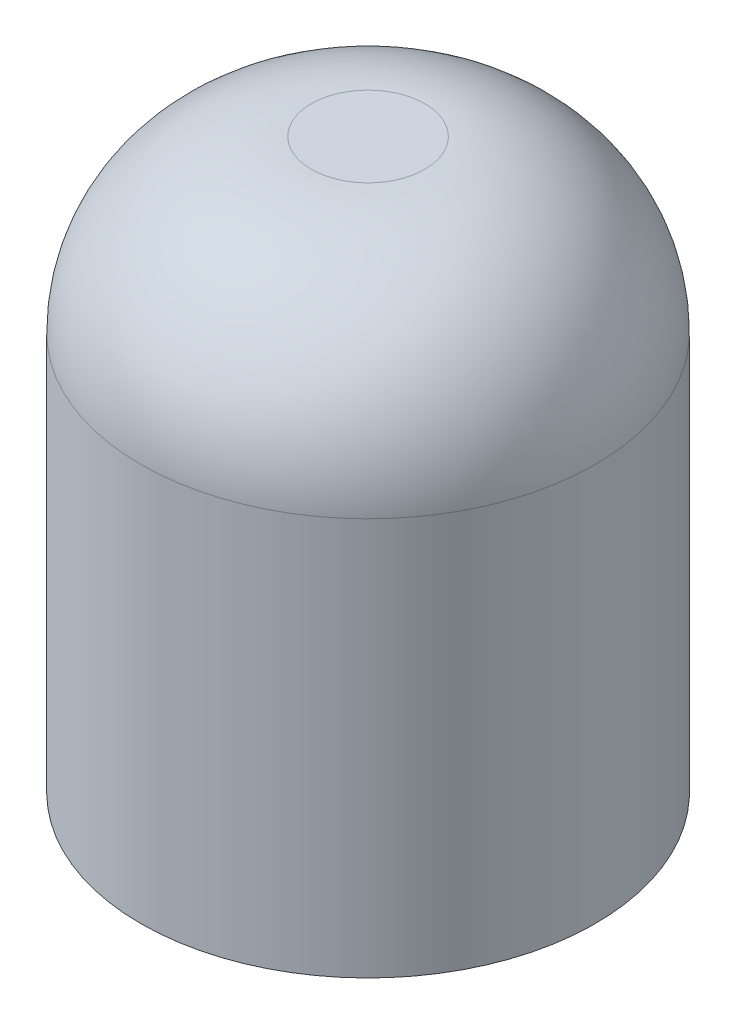
ISO-10303-21;
HEADER;
FILE_DESCRIPTION(('STEP AP214'),'2;1');
FILE_NAME('part.step','',(''),(''),'','','');
FILE_SCHEMA(('AUTOMOTIVE_DESIGN { 1 0 10303 214 1 1 1 1 }'));
ENDSEC;
DATA;
#1=APPLICATION_CONTEXT('core data for automotive mechanical design processes');
#2=APPLICATION_PROTOCOL_DEFINITION('international standard','automotive_design',2000,#1);
#3=PRODUCT_CONTEXT('',#1,'mechanical');
#4=PRODUCT('Part','Part','',(#3));
#5=PRODUCT_RELATED_PRODUCT_CATEGORY('part','',(#4));
#6=PRODUCT_DEFINITION_FORMATION('','',#4);
#7=PRODUCT_DEFINITION_CONTEXT('part definition',#1,'design');
#8=PRODUCT_DEFINITION('design','',#6,#7);
#9=PRODUCT_DEFINITION_SHAPE('','',#8);
#10=(LENGTH_UNIT() NAMED_UNIT(*) SI_UNIT(.MILLI.,.METRE.));
#11=(NAMED_UNIT(*) PLANE_ANGLE_UNIT() SI_UNIT($,.RADIAN.));
#12=(NAMED_UNIT(*) SI_UNIT($,.STERADIAN.) SOLID_ANGLE_UNIT());
#13=UNCERTAINTY_MEASURE_WITH_UNIT(LENGTH_MEASURE(1.E-05),#10,'distance_accuracy_value','');
#14=(GEOMETRIC_REPRESENTATION_CONTEXT(3) GLOBAL_UNCERTAINTY_ASSIGNED_CONTEXT((#13)) GLOBAL_UNIT_ASSIGNED_CONTEXT((#10,
#11,#12)) REPRESENTATION_CONTEXT('',''));
#15=CARTESIAN_POINT('',(0.,0.,0.));
#16=DIRECTION('',(0.,0.,1.));
#17=DIRECTION('',(1.,0.,0.));
#18=AXIS2_PLACEMENT_3D('',#15,#16,#17);
#19=CARTESIAN_POINT('',(0.,10.,0.));
#20=DIRECTION('',(0.,-1.,0.));
#21=DIRECTION('',(0.,0.,-1.));
#22=AXIS2_PLACEMENT_3D('',#19,#20,#21);
#23=CYLINDRICAL_SURFACE('',#22,4.);
#24=CARTESIAN_POINT('',(0.,7.,0.));
#25=DIRECTION('',(0.,1.,0.));
#26=DIRECTION('',(0.,0.,1.));
#27=AXIS2_PLACEMENT_3D('',#24,#25,#26);
#28=CIRCLE('',#27,4.);
#29=CARTESIAN_POINT('',(0.,7.,4.));
#30=VERTEX_POINT('',#29);
#31=EDGE_CURVE('E10',#30,#30,#28,.F.);
#32=ORIENTED_EDGE('',*,*,#31,.T.);
#33=EDGE_LOOP('',(#32));
#34=FACE_BOUND('',#33,.T.);
#35=CARTESIAN_POINT('',(0.,0.,0.));
#36=DIRECTION('',(0.,1.,0.));
#37=DIRECTION('',(0.,0.,1.));
#38=AXIS2_PLACEMENT_3D('',#35,#36,#37);
#39=CIRCLE('',#38,4.);
#40=CARTESIAN_POINT('',(0.,0.,4.));
#41=VERTEX_POINT('',#40);
#42=EDGE_CURVE('E42',#41,#41,#39,.T.);
#43=ORIENTED_EDGE('',*,*,#42,.T.);
#44=EDGE_LOOP('',(#43));
#45=FACE_BOUND('',#44,.T.);
#46=ADVANCED_FACE('F31',(#34,#45),#23,.T.);
#47=CARTESIAN_POINT('',(0.,10.,0.));
#48=DIRECTION('',(0.,1.,0.));
#49=DIRECTION('',(0.,0.,1.));
#50=AXIS2_PLACEMENT_3D('',#47,#48,#49);
#51=PLANE('',#50);
#52=CARTESIAN_POINT('',(0.,10.,0.));
#53=DIRECTION('',(0.,1.,0.));
#54=DIRECTION('',(0.,0.,1.));
#55=AXIS2_PLACEMENT_3D('',#52,#53,#54);
#56=CIRCLE('',#55,1.);
#57=CARTESIAN_POINT('',(0.,10.,1.));
#58=VERTEX_POINT('',#57);
#59=EDGE_CURVE('E38',#58,#58,#56,.T.);
#60=ORIENTED_EDGE('',*,*,#59,.T.);
#61=EDGE_LOOP('',(#60));
#62=FACE_BOUND('',#61,.T.);
#63=ADVANCED_FACE('F66',(#62),#51,.T.);
#64=CARTESIAN_POINT('',(0.,0.,0.));
#65=DIRECTION('',(0.,1.,0.));
#66=DIRECTION('',(0.,0.,1.));
#67=AXIS2_PLACEMENT_3D('',#64,#65,#66);
#68=PLANE('',#67);
#69=CARTESIAN_POINT('',(0.,0.,0.));
#70=DIRECTION('',(0.,-1.,0.));
#71=DIRECTION('',(0.,0.,-1.));
#72=AXIS2_PLACEMENT_3D('',#69,#70,#71);
#73=CIRCLE('',#72,1.5);
#74=CARTESIAN_POINT('',(0.,0.,-1.5));
#75=VERTEX_POINT('',#74);
#76=EDGE_CURVE('E49',#75,#75,#73,.T.);
#77=ORIENTED_EDGE('',*,*,#76,.F.);
#78=EDGE_LOOP('',(#77));
#79=FACE_BOUND('',#78,.T.);
#80=ORIENTED_EDGE('',*,*,#42,.F.);
#81=EDGE_LOOP('',(#80));
#82=FACE_BOUND('',#81,.T.);
#83=ADVANCED_FACE('F63',(#79,#82),#68,.F.);
#84=CARTESIAN_POINT('',(0.,7.,0.));
#85=DIRECTION('',(0.,1.,0.));
#86=DIRECTION('',(0.,0.,1.));
#87=AXIS2_PLACEMENT_3D('',#84,#85,#86);
#88=DEGENERATE_TOROIDAL_SURFACE('',#87,1.,3.,.T.);
#89=ORIENTED_EDGE('',*,*,#31,.F.);
#90=EDGE_LOOP('',(#89));
#91=FACE_BOUND('',#90,.T.);
#92=ORIENTED_EDGE('',*,*,#59,.F.);
#93=EDGE_LOOP('',(#92));
#94=FACE_BOUND('',#93,.T.);
#95=ADVANCED_FACE('F33',(#91,#94),#88,.T.);
#96=CARTESIAN_POINT('',(0.,5.,0.));
#97=DIRECTION('',(0.,-1.,0.));
#98=DIRECTION('',(0.,0.,-1.));
#99=AXIS2_PLACEMENT_3D('',#96,#97,#98);
#100=CYLINDRICAL_SURFACE('',#99,1.5);
#101=CARTESIAN_POINT('',(0.,5.,0.));
#102=DIRECTION('',(0.,-1.,0.));
#103=DIRECTION('',(0.,0.,-1.));
#104=AXIS2_PLACEMENT_3D('',#101,#102,#103);
#105=CIRCLE('',#104,1.5);
#106=CARTESIAN_POINT('',(0.,5.,-1.5));
#107=VERTEX_POINT('',#106);
#108=EDGE_CURVE('E46',#107,#107,#105,.T.);
#109=ORIENTED_EDGE('',*,*,#108,.F.);
#110=EDGE_LOOP('',(#109));
#111=FACE_BOUND('',#110,.T.);
#112=ORIENTED_EDGE('',*,*,#76,.T.);
#113=EDGE_LOOP('',(#112));
#114=FACE_BOUND('',#113,.T.);
#115=ADVANCED_FACE('F57',(#111,#114),#100,.F.);
#116=CARTESIAN_POINT('',(0.,5.,0.));
#117=DIRECTION('',(0.,-1.,0.));
#118=DIRECTION('',(0.,0.,-1.));
#119=AXIS2_PLACEMENT_3D('',#116,#117,#118);
#120=PLANE('',#119);
#121=ORIENTED_EDGE('',*,*,#108,.T.);
#122=EDGE_LOOP('',(#121));
#123=FACE_BOUND('',#122,.T.);
#124=ADVANCED_FACE('F55',(#123),#120,.T.);
#125=CLOSED_SHELL('',(#46,#63,#83,#95,#115,#124));
#126=MANIFOLD_SOLID_BREP('B2',#125);
#127=ADVANCED_BREP_SHAPE_REPRESENTATION('',(#18,#126),#14);
#128=SHAPE_DEFINITION_REPRESENTATION(#9,#127);
ENDSEC;
END-ISO-10303-21;
